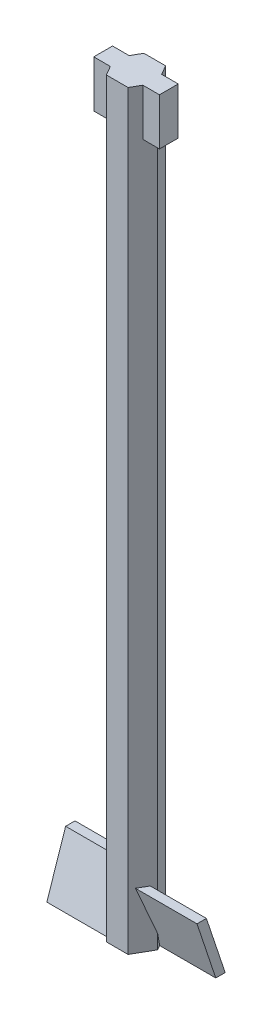
ISO-10303-21;
HEADER;
FILE_DESCRIPTION(('STEP AP214'),'2;1');
FILE_NAME('part.step','',(''),(''),'','','');
FILE_SCHEMA(('AUTOMOTIVE_DESIGN { 1 0 10303 214 1 1 1 1 }'));
ENDSEC;
DATA;
#1=APPLICATION_CONTEXT('core data for automotive mechanical design processes');
#2=APPLICATION_PROTOCOL_DEFINITION('international standard','automotive_design',2000,#1);
#3=PRODUCT_CONTEXT('',#1,'mechanical');
#4=PRODUCT('Part','Part','',(#3));
#5=PRODUCT_RELATED_PRODUCT_CATEGORY('part','',(#4));
#6=PRODUCT_DEFINITION_FORMATION('','',#4);
#7=PRODUCT_DEFINITION_CONTEXT('part definition',#1,'design');
#8=PRODUCT_DEFINITION('design','',#6,#7);
#9=PRODUCT_DEFINITION_SHAPE('','',#8);
#10=(LENGTH_UNIT() NAMED_UNIT(*) SI_UNIT(.MILLI.,.METRE.));
#11=(NAMED_UNIT(*) PLANE_ANGLE_UNIT() SI_UNIT($,.RADIAN.));
#12=(NAMED_UNIT(*) SI_UNIT($,.STERADIAN.) SOLID_ANGLE_UNIT());
#13=UNCERTAINTY_MEASURE_WITH_UNIT(LENGTH_MEASURE(1.E-05),#10,'distance_accuracy_value','');
#14=(GEOMETRIC_REPRESENTATION_CONTEXT(3) GLOBAL_UNCERTAINTY_ASSIGNED_CONTEXT((#13)) GLOBAL_UNIT_ASSIGNED_CONTEXT((#10,
#11,#12)) REPRESENTATION_CONTEXT('',''));
#15=CARTESIAN_POINT('',(0.,0.,0.));
#16=DIRECTION('',(0.,0.,1.));
#17=DIRECTION('',(1.,0.,0.));
#18=AXIS2_PLACEMENT_3D('',#15,#16,#17);
#19=CARTESIAN_POINT('',(-2.30940107675851,80.,0.));
#20=DIRECTION('',(0.866025403784443,0.,-0.499999999999993));
#21=DIRECTION('',(-0.499999999999993,0.,-0.866025403784443));
#22=AXIS2_PLACEMENT_3D('',#19,#20,#21);
#23=PLANE('',#22);
#24=DIRECTION('',(0.499999999999993,0.,0.866025403784443));
#25=VECTOR('',#24,1.);
#26=CARTESIAN_POINT('',(-2.30940107675851,0.,0.));
#27=LINE('',#26,#25);
#28=CARTESIAN_POINT('',(-2.30940107675851,0.,0.));
#29=VERTEX_POINT('',#28);
#30=CARTESIAN_POINT('',(-2.02072594216369,0.,0.5));
#31=VERTEX_POINT('',#30);
#32=EDGE_CURVE('E402',#29,#31,#27,.T.);
#33=ORIENTED_EDGE('',*,*,#32,.T.);
#34=DIRECTION('',(-0.179605302026771,0.933256525257383,-0.311085508419128));
#35=VECTOR('',#34,1.);
#36=CARTESIAN_POINT('',(-15.4673999536121,69.8709677419356,-22.7903225806452));
#37=LINE('',#36,#35);
#38=CARTESIAN_POINT('',(-2.30940107675851,1.50000000000007,0.));
#39=VERTEX_POINT('',#38);
#40=EDGE_CURVE('E247',#31,#39,#37,.T.);
#41=ORIENTED_EDGE('',*,*,#40,.T.);
#42=DIRECTION('',(0.,-1.,0.));
#43=VECTOR('',#42,1.);
#44=CARTESIAN_POINT('',(-2.30940107675851,80.,0.));
#45=LINE('',#44,#43);
#46=EDGE_CURVE('E431',#39,#29,#45,.T.);
#47=ORIENTED_EDGE('',*,*,#46,.T.);
#48=EDGE_LOOP('',(#33,#41,#47));
#49=FACE_BOUND('',#48,.T.);
#50=ADVANCED_FACE('F39',(#49),#23,.F.);
#51=CARTESIAN_POINT('',(1.15470053837924,80.,2.00000000000001));
#52=DIRECTION('',(-0.866025403784434,0.,-0.500000000000008));
#53=DIRECTION('',(-0.500000000000008,0.,0.866025403784434));
#54=AXIS2_PLACEMENT_3D('',#51,#52,#53);
#55=PLANE('',#54);
#56=DIRECTION('',(0.179605302026778,-0.933256525257382,-0.311085508419128));
#57=VECTOR('',#56,1.);
#58=CARTESIAN_POINT('',(-10.997591417951,70.6451612903225,23.0483870967742));
#59=LINE('',#58,#57);
#60=CARTESIAN_POINT('',(1.44337567297407,6.00000000000001,1.5));
#61=VERTEX_POINT('',#60);
#62=CARTESIAN_POINT('',(2.30940107675851,1.50000000000006,0.));
#63=VERTEX_POINT('',#62);
#64=EDGE_CURVE('E63',#61,#63,#59,.T.);
#65=ORIENTED_EDGE('',*,*,#64,.F.);
#66=DIRECTION('',(-0.500000000000008,0.,0.866025403784434));
#67=VECTOR('',#66,1.);
#68=CARTESIAN_POINT('',(1.15470053837924,6.00000000000001,2.00000000000001));
#69=LINE('',#68,#67);
#70=CARTESIAN_POINT('',(2.0207259421637,6.00000000000001,0.5));
#71=VERTEX_POINT('',#70);
#72=EDGE_CURVE('E48',#71,#61,#69,.T.);
#73=ORIENTED_EDGE('',*,*,#72,.F.);
#74=DIRECTION('',(-0.179605302026778,0.933256525257382,0.311085508419128));
#75=VECTOR('',#74,1.);
#76=CARTESIAN_POINT('',(-10.4947379576891,71.032258064516,22.1774193548387));
#77=LINE('',#76,#75);
#78=CARTESIAN_POINT('',(2.30940107675851,4.50000000000005,0.));
#79=VERTEX_POINT('',#78);
#80=EDGE_CURVE('E287',#79,#71,#77,.T.);
#81=ORIENTED_EDGE('',*,*,#80,.F.);
#82=DIRECTION('',(0.,-1.,0.));
#83=VECTOR('',#82,1.);
#84=CARTESIAN_POINT('',(2.30940107675851,80.,0.));
#85=LINE('',#84,#83);
#86=CARTESIAN_POINT('',(2.30940107675851,75.,0.));
#87=VERTEX_POINT('',#86);
#88=EDGE_CURVE('E420',#87,#79,#85,.T.);
#89=ORIENTED_EDGE('',*,*,#88,.F.);
#90=DIRECTION('',(0.500000000000008,0.,-0.866025403784434));
#91=VECTOR('',#90,1.);
#92=CARTESIAN_POINT('',(1.15470053837924,75.,2.00000000000001));
#93=LINE('',#92,#91);
#94=CARTESIAN_POINT('',(1.73205080756888,75.,1.));
#95=VERTEX_POINT('',#94);
#96=EDGE_CURVE('E361',#95,#87,#93,.T.);
#97=ORIENTED_EDGE('',*,*,#96,.F.);
#98=DIRECTION('',(0.,1.,0.));
#99=VECTOR('',#98,1.);
#100=CARTESIAN_POINT('',(1.73205080756888,80.,1.));
#101=LINE('',#100,#99);
#102=CARTESIAN_POINT('',(1.73205080756888,80.,1.));
#103=VERTEX_POINT('',#102);
#104=EDGE_CURVE('E353',#95,#103,#101,.T.);
#105=ORIENTED_EDGE('',*,*,#104,.T.);
#106=DIRECTION('',(0.500000000000008,0.,-0.866025403784434));
#107=VECTOR('',#106,1.);
#108=CARTESIAN_POINT('',(1.15470053837924,80.,2.00000000000001));
#109=LINE('',#108,#107);
#110=CARTESIAN_POINT('',(1.15470053837924,80.,2.00000000000001));
#111=VERTEX_POINT('',#110);
#112=EDGE_CURVE('E386',#111,#103,#109,.T.);
#113=ORIENTED_EDGE('',*,*,#112,.F.);
#114=DIRECTION('',(0.,-1.,0.));
#115=VECTOR('',#114,1.);
#116=CARTESIAN_POINT('',(1.15470053837924,80.,2.00000000000001));
#117=LINE('',#116,#115);
#118=CARTESIAN_POINT('',(1.15470053837924,0.,2.00000000000001));
#119=VERTEX_POINT('',#118);
#120=EDGE_CURVE('E423',#111,#119,#117,.T.);
#121=ORIENTED_EDGE('',*,*,#120,.T.);
#122=DIRECTION('',(0.500000000000008,0.,-0.866025403784434));
#123=VECTOR('',#122,1.);
#124=CARTESIAN_POINT('',(1.15470053837924,0.,2.00000000000001));
#125=LINE('',#124,#123);
#126=CARTESIAN_POINT('',(2.30940107675851,0.,0.));
#127=VERTEX_POINT('',#126);
#128=EDGE_CURVE('E409',#119,#127,#125,.T.);
#129=ORIENTED_EDGE('',*,*,#128,.T.);
#130=EDGE_CURVE('E419',#63,#127,#85,.T.);
#131=ORIENTED_EDGE('',*,*,#130,.F.);
#132=EDGE_LOOP('',(#65,#73,#81,#89,#97,#105,#113,#121,#129,#131));
#133=FACE_BOUND('',#132,.T.);
#134=ADVANCED_FACE('F460',(#133),#55,.F.);
#135=CARTESIAN_POINT('',(2.30940107675851,80.,0.));
#136=DIRECTION('',(-0.866025403784443,0.,0.499999999999992));
#137=DIRECTION('',(0.499999999999992,0.,0.866025403784443));
#138=AXIS2_PLACEMENT_3D('',#135,#136,#137);
#139=PLANE('',#138);
#140=DIRECTION('',(-0.179605302026771,-0.933256525257383,-0.311085508419128));
#141=VECTOR('',#140,1.);
#142=CARTESIAN_POINT('',(15.4673999536121,69.8709677419356,22.7903225806452));
#143=LINE('',#142,#141);
#144=CARTESIAN_POINT('',(2.02072594216369,0.,-0.5));
#145=VERTEX_POINT('',#144);
#146=EDGE_CURVE('E291',#63,#145,#143,.T.);
#147=ORIENTED_EDGE('',*,*,#146,.F.);
#148=ORIENTED_EDGE('',*,*,#130,.T.);
#149=DIRECTION('',(-0.499999999999992,0.,-0.866025403784443));
#150=VECTOR('',#149,1.);
#151=CARTESIAN_POINT('',(2.30940107675851,0.,0.));
#152=LINE('',#151,#150);
#153=EDGE_CURVE('E376',#127,#145,#152,.T.);
#154=ORIENTED_EDGE('',*,*,#153,.T.);
#155=EDGE_LOOP('',(#147,#148,#154));
#156=FACE_BOUND('',#155,.T.);
#157=ADVANCED_FACE('F531',(#156),#139,.F.);
#158=DIRECTION('',(0.179605302026771,0.933256525257383,0.311085508419128));
#159=VECTOR('',#158,1.);
#160=CARTESIAN_POINT('',(14.9645464933502,70.2580645161291,21.9193548387097));
#161=LINE('',#160,#159);
#162=CARTESIAN_POINT('',(1.44337567297408,0.,-1.5));
#163=VERTEX_POINT('',#162);
#164=EDGE_CURVE('E283',#163,#79,#161,.T.);
#165=ORIENTED_EDGE('',*,*,#164,.F.);
#166=CARTESIAN_POINT('',(1.15470053837927,0.,-2.));
#167=VERTEX_POINT('',#166);
#168=EDGE_CURVE('E413',#163,#167,#152,.T.);
#169=ORIENTED_EDGE('',*,*,#168,.T.);
#170=DIRECTION('',(0.,-1.,0.));
#171=VECTOR('',#170,1.);
#172=CARTESIAN_POINT('',(1.15470053837927,80.,-2.));
#173=LINE('',#172,#171);
#174=CARTESIAN_POINT('',(1.15470053837927,80.,-2.));
#175=VERTEX_POINT('',#174);
#176=EDGE_CURVE('E393',#175,#167,#173,.T.);
#177=ORIENTED_EDGE('',*,*,#176,.F.);
#178=DIRECTION('',(-0.499999999999992,0.,-0.866025403784443));
#179=VECTOR('',#178,1.);
#180=CARTESIAN_POINT('',(2.30940107675851,80.,0.));
#181=LINE('',#180,#179);
#182=CARTESIAN_POINT('',(1.73205080756888,80.,-1.));
#183=VERTEX_POINT('',#182);
#184=EDGE_CURVE('E390',#183,#175,#181,.T.);
#185=ORIENTED_EDGE('',*,*,#184,.F.);
#186=DIRECTION('',(0.,-1.,0.));
#187=VECTOR('',#186,1.);
#188=CARTESIAN_POINT('',(1.73205080756888,80.,-1.));
#189=LINE('',#188,#187);
#190=CARTESIAN_POINT('',(1.73205080756888,75.,-1.));
#191=VERTEX_POINT('',#190);
#192=EDGE_CURVE('E336',#183,#191,#189,.T.);
#193=ORIENTED_EDGE('',*,*,#192,.T.);
#194=DIRECTION('',(-0.499999999999992,0.,-0.866025403784443));
#195=VECTOR('',#194,1.);
#196=CARTESIAN_POINT('',(2.30940107675851,75.,0.));
#197=LINE('',#196,#195);
#198=EDGE_CURVE('E440',#87,#191,#197,.T.);
#199=ORIENTED_EDGE('',*,*,#198,.F.);
#200=ORIENTED_EDGE('',*,*,#88,.T.);
#201=EDGE_LOOP('',(#165,#169,#177,#185,#193,#199,#200));
#202=FACE_BOUND('',#201,.T.);
#203=ADVANCED_FACE('F464',(#202),#139,.F.);
#204=CARTESIAN_POINT('',(1.15470053837927,80.,-2.));
#205=DIRECTION('',(0.,0.,1.));
#206=DIRECTION('',(1.,0.,0.));
#207=AXIS2_PLACEMENT_3D('',#204,#205,#206);
#208=PLANE('',#207);
#209=DIRECTION('',(-1.,0.,0.));
#210=VECTOR('',#209,1.);
#211=CARTESIAN_POINT('',(1.15470053837927,0.,-2.));
#212=LINE('',#211,#210);
#213=CARTESIAN_POINT('',(-1.15470053837924,0.,-2.00000000000002));
#214=VERTEX_POINT('',#213);
#215=EDGE_CURVE('E370',#167,#214,#212,.T.);
#216=ORIENTED_EDGE('',*,*,#215,.T.);
#217=DIRECTION('',(0.,-1.,0.));
#218=VECTOR('',#217,1.);
#219=CARTESIAN_POINT('',(-1.15470053837924,80.,-2.00000000000002));
#220=LINE('',#219,#218);
#221=CARTESIAN_POINT('',(-1.15470053837924,80.,-2.00000000000002));
#222=VERTEX_POINT('',#221);
#223=EDGE_CURVE('E436',#222,#214,#220,.T.);
#224=ORIENTED_EDGE('',*,*,#223,.F.);
#225=DIRECTION('',(-1.,0.,0.));
#226=VECTOR('',#225,1.);
#227=CARTESIAN_POINT('',(1.15470053837927,80.,-2.));
#228=LINE('',#227,#226);
#229=EDGE_CURVE('E371',#175,#222,#228,.T.);
#230=ORIENTED_EDGE('',*,*,#229,.F.);
#231=ORIENTED_EDGE('',*,*,#176,.T.);
#232=EDGE_LOOP('',(#216,#224,#230,#231));
#233=FACE_BOUND('',#232,.T.);
#234=ADVANCED_FACE('F41',(#233),#208,.F.);
#235=CARTESIAN_POINT('',(-1.15470053837924,80.,-2.00000000000002));
#236=DIRECTION('',(0.866025403784434,0.,0.500000000000008));
#237=DIRECTION('',(0.500000000000008,0.,-0.866025403784434));
#238=AXIS2_PLACEMENT_3D('',#235,#236,#237);
#239=PLANE('',#238);
#240=ORIENTED_EDGE('',*,*,#46,.F.);
#241=DIRECTION('',(0.179605302026779,0.933256525257382,-0.311085508419127));
#242=VECTOR('',#241,1.);
#243=CARTESIAN_POINT('',(10.997591417951,70.6451612903225,-23.0483870967742));
#244=LINE('',#243,#242);
#245=CARTESIAN_POINT('',(-1.44337567297407,6.,-1.5));
#246=VERTEX_POINT('',#245);
#247=EDGE_CURVE('E251',#39,#246,#244,.T.);
#248=ORIENTED_EDGE('',*,*,#247,.T.);
#249=DIRECTION('',(-0.500000000000008,0.,0.866025403784434));
#250=VECTOR('',#249,1.);
#251=CARTESIAN_POINT('',(-1.15470053837924,6.00000000000001,-2.00000000000002));
#252=LINE('',#251,#250);
#253=CARTESIAN_POINT('',(-2.0207259421637,6.,-0.5));
#254=VERTEX_POINT('',#253);
#255=EDGE_CURVE('E11',#246,#254,#252,.T.);
#256=ORIENTED_EDGE('',*,*,#255,.T.);
#257=DIRECTION('',(-0.179605302026779,-0.933256525257382,0.311085508419127));
#258=VECTOR('',#257,1.);
#259=CARTESIAN_POINT('',(10.4947379576891,71.032258064516,-22.1774193548387));
#260=LINE('',#259,#258);
#261=CARTESIAN_POINT('',(-2.30940107675851,4.50000000000006,0.));
#262=VERTEX_POINT('',#261);
#263=EDGE_CURVE('E243',#254,#262,#260,.T.);
#264=ORIENTED_EDGE('',*,*,#263,.T.);
#265=CARTESIAN_POINT('',(-2.30940107675851,75.,0.));
#266=VERTEX_POINT('',#265);
#267=EDGE_CURVE('E432',#266,#262,#45,.T.);
#268=ORIENTED_EDGE('',*,*,#267,.F.);
#269=DIRECTION('',(-0.500000000000008,0.,0.866025403784434));
#270=VECTOR('',#269,1.);
#271=CARTESIAN_POINT('',(-1.15470053837924,75.,-2.00000000000002));
#272=LINE('',#271,#270);
#273=CARTESIAN_POINT('',(-1.73205080756888,75.,-0.999999999999999));
#274=VERTEX_POINT('',#273);
#275=EDGE_CURVE('E367',#274,#266,#272,.T.);
#276=ORIENTED_EDGE('',*,*,#275,.F.);
#277=DIRECTION('',(0.,1.,0.));
#278=VECTOR('',#277,1.);
#279=CARTESIAN_POINT('',(-1.73205080756888,80.,-1.));
#280=LINE('',#279,#278);
#281=CARTESIAN_POINT('',(-1.73205080756888,80.,-1.));
#282=VERTEX_POINT('',#281);
#283=EDGE_CURVE('E349',#274,#282,#280,.T.);
#284=ORIENTED_EDGE('',*,*,#283,.T.);
#285=DIRECTION('',(-0.500000000000008,0.,0.866025403784434));
#286=VECTOR('',#285,1.);
#287=CARTESIAN_POINT('',(-1.15470053837924,80.,-2.00000000000002));
#288=LINE('',#287,#286);
#289=EDGE_CURVE('E375',#222,#282,#288,.T.);
#290=ORIENTED_EDGE('',*,*,#289,.F.);
#291=ORIENTED_EDGE('',*,*,#223,.T.);
#292=DIRECTION('',(-0.500000000000008,0.,0.866025403784434));
#293=VECTOR('',#292,1.);
#294=CARTESIAN_POINT('',(-1.15470053837924,0.,-2.00000000000002));
#295=LINE('',#294,#293);
#296=EDGE_CURVE('E397',#214,#29,#295,.T.);
#297=ORIENTED_EDGE('',*,*,#296,.T.);
#298=EDGE_LOOP('',(#240,#248,#256,#264,#268,#276,#284,#290,#291,#297));
#299=FACE_BOUND('',#298,.T.);
#300=ADVANCED_FACE('F535',(#299),#239,.F.);
#301=ORIENTED_EDGE('',*,*,#267,.T.);
#302=DIRECTION('',(0.179605302026771,-0.933256525257383,0.311085508419128));
#303=VECTOR('',#302,1.);
#304=CARTESIAN_POINT('',(-14.9645464933502,70.2580645161291,-21.9193548387097));
#305=LINE('',#304,#303);
#306=CARTESIAN_POINT('',(-1.44337567297407,0.,1.5));
#307=VERTEX_POINT('',#306);
#308=EDGE_CURVE('E236',#262,#307,#305,.T.);
#309=ORIENTED_EDGE('',*,*,#308,.T.);
#310=CARTESIAN_POINT('',(-1.15470053837927,0.,1.99999999999999));
#311=VERTEX_POINT('',#310);
#312=EDGE_CURVE('E401',#307,#311,#27,.T.);
#313=ORIENTED_EDGE('',*,*,#312,.T.);
#314=DIRECTION('',(0.,-1.,0.));
#315=VECTOR('',#314,1.);
#316=CARTESIAN_POINT('',(-1.15470053837927,80.,1.99999999999999));
#317=LINE('',#316,#315);
#318=CARTESIAN_POINT('',(-1.15470053837927,80.,1.99999999999999));
#319=VERTEX_POINT('',#318);
#320=EDGE_CURVE('E427',#319,#311,#317,.T.);
#321=ORIENTED_EDGE('',*,*,#320,.F.);
#322=DIRECTION('',(0.499999999999993,0.,0.866025403784443));
#323=VECTOR('',#322,1.);
#324=CARTESIAN_POINT('',(-2.30940107675851,80.,0.));
#325=LINE('',#324,#323);
#326=CARTESIAN_POINT('',(-1.73205080756888,80.,1.));
#327=VERTEX_POINT('',#326);
#328=EDGE_CURVE('E380',#327,#319,#325,.T.);
#329=ORIENTED_EDGE('',*,*,#328,.F.);
#330=DIRECTION('',(0.,-1.,0.));
#331=VECTOR('',#330,1.);
#332=CARTESIAN_POINT('',(-1.73205080756888,80.,1.));
#333=LINE('',#332,#331);
#334=CARTESIAN_POINT('',(-1.73205080756888,75.,1.));
#335=VERTEX_POINT('',#334);
#336=EDGE_CURVE('E357',#327,#335,#333,.T.);
#337=ORIENTED_EDGE('',*,*,#336,.T.);
#338=DIRECTION('',(0.499999999999993,0.,0.866025403784443));
#339=VECTOR('',#338,1.);
#340=CARTESIAN_POINT('',(-2.30940107675851,75.,0.));
#341=LINE('',#340,#339);
#342=EDGE_CURVE('E364',#266,#335,#341,.T.);
#343=ORIENTED_EDGE('',*,*,#342,.F.);
#344=EDGE_LOOP('',(#301,#309,#313,#321,#329,#337,#343));
#345=FACE_BOUND('',#344,.T.);
#346=ADVANCED_FACE('F505',(#345),#23,.F.);
#347=CARTESIAN_POINT('',(-1.15470053837927,80.,1.99999999999999));
#348=DIRECTION('',(0.,0.,-1.));
#349=DIRECTION('',(-1.,0.,0.));
#350=AXIS2_PLACEMENT_3D('',#347,#348,#349);
#351=PLANE('',#350);
#352=DIRECTION('',(1.,0.,0.));
#353=VECTOR('',#352,1.);
#354=CARTESIAN_POINT('',(-1.15470053837927,0.,1.99999999999999));
#355=LINE('',#354,#353);
#356=EDGE_CURVE('E406',#311,#119,#355,.T.);
#357=ORIENTED_EDGE('',*,*,#356,.T.);
#358=ORIENTED_EDGE('',*,*,#120,.F.);
#359=DIRECTION('',(1.,0.,0.));
#360=VECTOR('',#359,1.);
#361=CARTESIAN_POINT('',(-1.15470053837927,80.,1.99999999999999));
#362=LINE('',#361,#360);
#363=EDGE_CURVE('E383',#319,#111,#362,.T.);
#364=ORIENTED_EDGE('',*,*,#363,.F.);
#365=ORIENTED_EDGE('',*,*,#320,.T.);
#366=EDGE_LOOP('',(#357,#358,#364,#365));
#367=FACE_BOUND('',#366,.T.);
#368=ADVANCED_FACE('F509',(#367),#351,.F.);
#369=CARTESIAN_POINT('',(0.,80.,0.));
#370=DIRECTION('',(0.,1.,0.));
#371=DIRECTION('',(0.,0.,1.));
#372=AXIS2_PLACEMENT_3D('',#369,#370,#371);
#373=PLANE('',#372);
#374=ORIENTED_EDGE('',*,*,#289,.T.);
#375=DIRECTION('',(-1.,0.,0.));
#376=VECTOR('',#375,1.);
#377=CARTESIAN_POINT('',(-3.5,80.,-1.));
#378=LINE('',#377,#376);
#379=CARTESIAN_POINT('',(-3.5,80.,-1.));
#380=VERTEX_POINT('',#379);
#381=EDGE_CURVE('E321',#282,#380,#378,.T.);
#382=ORIENTED_EDGE('',*,*,#381,.T.);
#383=DIRECTION('',(0.,0.,1.));
#384=VECTOR('',#383,1.);
#385=CARTESIAN_POINT('',(-3.5,80.,-1.));
#386=LINE('',#385,#384);
#387=CARTESIAN_POINT('',(-3.5,80.,1.));
#388=VERTEX_POINT('',#387);
#389=EDGE_CURVE('E325',#380,#388,#386,.T.);
#390=ORIENTED_EDGE('',*,*,#389,.T.);
#391=DIRECTION('',(1.,0.,0.));
#392=VECTOR('',#391,1.);
#393=CARTESIAN_POINT('',(-3.5,80.,1.));
#394=LINE('',#393,#392);
#395=EDGE_CURVE('E303',#388,#327,#394,.T.);
#396=ORIENTED_EDGE('',*,*,#395,.T.);
#397=ORIENTED_EDGE('',*,*,#328,.T.);
#398=ORIENTED_EDGE('',*,*,#363,.T.);
#399=ORIENTED_EDGE('',*,*,#112,.T.);
#400=CARTESIAN_POINT('',(3.5,80.,1.));
#401=VERTEX_POINT('',#400);
#402=EDGE_CURVE('E329',#103,#401,#394,.T.);
#403=ORIENTED_EDGE('',*,*,#402,.T.);
#404=DIRECTION('',(0.,0.,-1.));
#405=VECTOR('',#404,1.);
#406=CARTESIAN_POINT('',(3.5,80.,-1.));
#407=LINE('',#406,#405);
#408=CARTESIAN_POINT('',(3.5,80.,-1.));
#409=VERTEX_POINT('',#408);
#410=EDGE_CURVE('E297',#401,#409,#407,.T.);
#411=ORIENTED_EDGE('',*,*,#410,.T.);
#412=EDGE_CURVE('E322',#409,#183,#378,.T.);
#413=ORIENTED_EDGE('',*,*,#412,.T.);
#414=ORIENTED_EDGE('',*,*,#184,.T.);
#415=ORIENTED_EDGE('',*,*,#229,.T.);
#416=EDGE_LOOP('',(#374,#382,#390,#396,#397,#398,#399,#403,#411,#413,#414,#415));
#417=FACE_BOUND('',#416,.T.);
#418=ADVANCED_FACE('F486',(#417),#373,.T.);
#419=CARTESIAN_POINT('',(0.,0.,0.));
#420=DIRECTION('',(0.,1.,0.));
#421=DIRECTION('',(0.,0.,1.));
#422=AXIS2_PLACEMENT_3D('',#419,#420,#421);
#423=PLANE('',#422);
#424=ORIENTED_EDGE('',*,*,#312,.F.);
#425=DIRECTION('',(1.,0.,0.));
#426=VECTOR('',#425,1.);
#427=CARTESIAN_POINT('',(-8.,0.,1.5));
#428=LINE('',#427,#426);
#429=CARTESIAN_POINT('',(-8.,0.,1.5));
#430=VERTEX_POINT('',#429);
#431=EDGE_CURVE('E55',#430,#307,#428,.T.);
#432=ORIENTED_EDGE('',*,*,#431,.F.);
#433=DIRECTION('',(0.,0.,-1.));
#434=VECTOR('',#433,1.);
#435=CARTESIAN_POINT('',(-8.,0.,1.5));
#436=LINE('',#435,#434);
#437=CARTESIAN_POINT('',(-8.,0.,0.5));
#438=VERTEX_POINT('',#437);
#439=EDGE_CURVE('E212',#430,#438,#436,.T.);
#440=ORIENTED_EDGE('',*,*,#439,.T.);
#441=DIRECTION('',(1.,0.,0.));
#442=VECTOR('',#441,1.);
#443=CARTESIAN_POINT('',(-8.,0.,0.5));
#444=LINE('',#443,#442);
#445=EDGE_CURVE('E226',#438,#31,#444,.T.);
#446=ORIENTED_EDGE('',*,*,#445,.T.);
#447=ORIENTED_EDGE('',*,*,#32,.F.);
#448=ORIENTED_EDGE('',*,*,#296,.F.);
#449=ORIENTED_EDGE('',*,*,#215,.F.);
#450=ORIENTED_EDGE('',*,*,#168,.F.);
#451=DIRECTION('',(-1.,0.,0.));
#452=VECTOR('',#451,1.);
#453=CARTESIAN_POINT('',(8.,0.,-1.5));
#454=LINE('',#453,#452);
#455=CARTESIAN_POINT('',(8.,0.,-1.5));
#456=VERTEX_POINT('',#455);
#457=EDGE_CURVE('E275',#456,#163,#454,.T.);
#458=ORIENTED_EDGE('',*,*,#457,.F.);
#459=DIRECTION('',(0.,0.,-1.));
#460=VECTOR('',#459,1.);
#461=CARTESIAN_POINT('',(8.,0.,-1.5));
#462=LINE('',#461,#460);
#463=CARTESIAN_POINT('',(8.,0.,-0.5));
#464=VERTEX_POINT('',#463);
#465=EDGE_CURVE('E258',#464,#456,#462,.T.);
#466=ORIENTED_EDGE('',*,*,#465,.F.);
#467=DIRECTION('',(-1.,0.,0.));
#468=VECTOR('',#467,1.);
#469=CARTESIAN_POINT('',(8.,0.,-0.5));
#470=LINE('',#469,#468);
#471=EDGE_CURVE('E279',#464,#145,#470,.T.);
#472=ORIENTED_EDGE('',*,*,#471,.T.);
#473=ORIENTED_EDGE('',*,*,#153,.F.);
#474=ORIENTED_EDGE('',*,*,#128,.F.);
#475=ORIENTED_EDGE('',*,*,#356,.F.);
#476=EDGE_LOOP('',(#424,#432,#440,#446,#447,#448,#449,#450,#458,#466,#472,#473,#474,#475));
#477=FACE_BOUND('',#476,.T.);
#478=ADVANCED_FACE('F556',(#477),#423,.F.);
#479=CARTESIAN_POINT('',(3.5,75.,-1.));
#480=DIRECTION('',(1.,0.,0.));
#481=DIRECTION('',(0.,0.,-1.));
#482=AXIS2_PLACEMENT_3D('',#479,#480,#481);
#483=PLANE('',#482);
#484=ORIENTED_EDGE('',*,*,#410,.F.);
#485=DIRECTION('',(0.,1.,0.));
#486=VECTOR('',#485,1.);
#487=CARTESIAN_POINT('',(3.5,75.,1.));
#488=LINE('',#487,#486);
#489=CARTESIAN_POINT('',(3.5,75.,1.));
#490=VERTEX_POINT('',#489);
#491=EDGE_CURVE('E332',#490,#401,#488,.T.);
#492=ORIENTED_EDGE('',*,*,#491,.F.);
#493=DIRECTION('',(0.,0.,-1.));
#494=VECTOR('',#493,1.);
#495=CARTESIAN_POINT('',(3.5,75.,-1.));
#496=LINE('',#495,#494);
#497=CARTESIAN_POINT('',(3.5,75.,-1.));
#498=VERTEX_POINT('',#497);
#499=EDGE_CURVE('E298',#490,#498,#496,.T.);
#500=ORIENTED_EDGE('',*,*,#499,.T.);
#501=DIRECTION('',(0.,1.,0.));
#502=VECTOR('',#501,1.);
#503=CARTESIAN_POINT('',(3.5,75.,-1.));
#504=LINE('',#503,#502);
#505=EDGE_CURVE('E317',#498,#409,#504,.T.);
#506=ORIENTED_EDGE('',*,*,#505,.T.);
#507=EDGE_LOOP('',(#484,#492,#500,#506));
#508=FACE_BOUND('',#507,.T.);
#509=ADVANCED_FACE('F478',(#508),#483,.T.);
#510=CARTESIAN_POINT('',(0.,75.,0.));
#511=DIRECTION('',(0.,1.,0.));
#512=DIRECTION('',(0.,0.,1.));
#513=AXIS2_PLACEMENT_3D('',#510,#511,#512);
#514=PLANE('',#513);
#515=DIRECTION('',(1.,0.,0.));
#516=VECTOR('',#515,1.);
#517=CARTESIAN_POINT('',(-3.5,75.,1.));
#518=LINE('',#517,#516);
#519=EDGE_CURVE('E312',#95,#490,#518,.T.);
#520=ORIENTED_EDGE('',*,*,#519,.F.);
#521=ORIENTED_EDGE('',*,*,#96,.T.);
#522=ORIENTED_EDGE('',*,*,#198,.T.);
#523=DIRECTION('',(-1.,0.,0.));
#524=VECTOR('',#523,1.);
#525=CARTESIAN_POINT('',(-3.5,75.,-1.));
#526=LINE('',#525,#524);
#527=EDGE_CURVE('E304',#498,#191,#526,.T.);
#528=ORIENTED_EDGE('',*,*,#527,.F.);
#529=ORIENTED_EDGE('',*,*,#499,.F.);
#530=EDGE_LOOP('',(#520,#521,#522,#528,#529));
#531=FACE_BOUND('',#530,.T.);
#532=ADVANCED_FACE('F471',(#531),#514,.F.);
#533=CARTESIAN_POINT('',(-3.5,75.,-1.));
#534=DIRECTION('',(0.,0.,-1.));
#535=DIRECTION('',(-1.,0.,0.));
#536=AXIS2_PLACEMENT_3D('',#533,#534,#535);
#537=PLANE('',#536);
#538=ORIENTED_EDGE('',*,*,#192,.F.);
#539=ORIENTED_EDGE('',*,*,#412,.F.);
#540=ORIENTED_EDGE('',*,*,#505,.F.);
#541=ORIENTED_EDGE('',*,*,#527,.T.);
#542=EDGE_LOOP('',(#538,#539,#540,#541));
#543=FACE_BOUND('',#542,.T.);
#544=ADVANCED_FACE('F474',(#543),#537,.T.);
#545=CARTESIAN_POINT('',(-3.5,75.,1.));
#546=DIRECTION('',(0.,0.,1.));
#547=DIRECTION('',(1.,0.,0.));
#548=AXIS2_PLACEMENT_3D('',#545,#546,#547);
#549=PLANE('',#548);
#550=ORIENTED_EDGE('',*,*,#104,.F.);
#551=ORIENTED_EDGE('',*,*,#519,.T.);
#552=ORIENTED_EDGE('',*,*,#491,.T.);
#553=ORIENTED_EDGE('',*,*,#402,.F.);
#554=EDGE_LOOP('',(#550,#551,#552,#553));
#555=FACE_BOUND('',#554,.T.);
#556=ADVANCED_FACE('F512',(#555),#549,.T.);
#557=CARTESIAN_POINT('',(-3.5,75.,-1.));
#558=VERTEX_POINT('',#557);
#559=EDGE_CURVE('E302',#274,#558,#526,.T.);
#560=ORIENTED_EDGE('',*,*,#559,.F.);
#561=ORIENTED_EDGE('',*,*,#275,.T.);
#562=ORIENTED_EDGE('',*,*,#342,.T.);
#563=CARTESIAN_POINT('',(-3.5,75.,1.));
#564=VERTEX_POINT('',#563);
#565=EDGE_CURVE('E313',#564,#335,#518,.T.);
#566=ORIENTED_EDGE('',*,*,#565,.F.);
#567=DIRECTION('',(0.,0.,1.));
#568=VECTOR('',#567,1.);
#569=CARTESIAN_POINT('',(-3.5,75.,-1.));
#570=LINE('',#569,#568);
#571=EDGE_CURVE('E308',#558,#564,#570,.T.);
#572=ORIENTED_EDGE('',*,*,#571,.F.);
#573=EDGE_LOOP('',(#560,#561,#562,#566,#572));
#574=FACE_BOUND('',#573,.T.);
#575=ADVANCED_FACE('F514',(#574),#514,.F.);
#576=ORIENTED_EDGE('',*,*,#336,.F.);
#577=ORIENTED_EDGE('',*,*,#395,.F.);
#578=DIRECTION('',(0.,1.,0.));
#579=VECTOR('',#578,1.);
#580=CARTESIAN_POINT('',(-3.5,75.,1.));
#581=LINE('',#580,#579);
#582=EDGE_CURVE('E337',#564,#388,#581,.T.);
#583=ORIENTED_EDGE('',*,*,#582,.F.);
#584=ORIENTED_EDGE('',*,*,#565,.T.);
#585=EDGE_LOOP('',(#576,#577,#583,#584));
#586=FACE_BOUND('',#585,.T.);
#587=ADVANCED_FACE('F499',(#586),#549,.T.);
#588=ORIENTED_EDGE('',*,*,#283,.F.);
#589=ORIENTED_EDGE('',*,*,#559,.T.);
#590=DIRECTION('',(0.,1.,0.));
#591=VECTOR('',#590,1.);
#592=CARTESIAN_POINT('',(-3.5,75.,-1.));
#593=LINE('',#592,#591);
#594=EDGE_CURVE('E340',#558,#380,#593,.T.);
#595=ORIENTED_EDGE('',*,*,#594,.T.);
#596=ORIENTED_EDGE('',*,*,#381,.F.);
#597=EDGE_LOOP('',(#588,#589,#595,#596));
#598=FACE_BOUND('',#597,.T.);
#599=ADVANCED_FACE('F491',(#598),#537,.T.);
#600=CARTESIAN_POINT('',(-3.5,75.,-1.));
#601=DIRECTION('',(-1.,0.,0.));
#602=DIRECTION('',(0.,0.,1.));
#603=AXIS2_PLACEMENT_3D('',#600,#601,#602);
#604=PLANE('',#603);
#605=ORIENTED_EDGE('',*,*,#389,.F.);
#606=ORIENTED_EDGE('',*,*,#594,.F.);
#607=ORIENTED_EDGE('',*,*,#571,.T.);
#608=ORIENTED_EDGE('',*,*,#582,.T.);
#609=EDGE_LOOP('',(#605,#606,#607,#608));
#610=FACE_BOUND('',#609,.T.);
#611=ADVANCED_FACE('F495',(#610),#604,.T.);
#612=CARTESIAN_POINT('',(8.,6.,1.5));
#613=DIRECTION('',(0.,-1.,0.));
#614=DIRECTION('',(0.,0.,-1.));
#615=AXIS2_PLACEMENT_3D('',#612,#613,#614);
#616=PLANE('',#615);
#617=DIRECTION('',(-1.,0.,0.));
#618=VECTOR('',#617,1.);
#619=CARTESIAN_POINT('',(8.,6.,0.5));
#620=LINE('',#619,#618);
#621=CARTESIAN_POINT('',(8.,6.,0.5));
#622=VERTEX_POINT('',#621);
#623=EDGE_CURVE('E271',#622,#71,#620,.T.);
#624=ORIENTED_EDGE('',*,*,#623,.T.);
#625=ORIENTED_EDGE('',*,*,#72,.T.);
#626=DIRECTION('',(-1.,0.,0.));
#627=VECTOR('',#626,1.);
#628=CARTESIAN_POINT('',(8.,6.,1.5));
#629=LINE('',#628,#627);
#630=CARTESIAN_POINT('',(8.,6.,1.5));
#631=VERTEX_POINT('',#630);
#632=EDGE_CURVE('E267',#631,#61,#629,.T.);
#633=ORIENTED_EDGE('',*,*,#632,.F.);
#634=DIRECTION('',(0.,0.,1.));
#635=VECTOR('',#634,1.);
#636=CARTESIAN_POINT('',(8.,6.,1.5));
#637=LINE('',#636,#635);
#638=EDGE_CURVE('E264',#622,#631,#637,.T.);
#639=ORIENTED_EDGE('',*,*,#638,.F.);
#640=EDGE_LOOP('',(#624,#625,#633,#639));
#641=FACE_BOUND('',#640,.T.);
#642=ADVANCED_FACE('F445',(#641),#616,.F.);
#643=CARTESIAN_POINT('',(8.,6.,1.5));
#644=DIRECTION('',(0.,0.316227766016838,-0.948683298050514));
#645=DIRECTION('',(0.,0.948683298050514,0.316227766016838));
#646=AXIS2_PLACEMENT_3D('',#643,#644,#645);
#647=PLANE('',#646);
#648=ORIENTED_EDGE('',*,*,#632,.T.);
#649=ORIENTED_EDGE('',*,*,#64,.T.);
#650=ORIENTED_EDGE('',*,*,#146,.T.);
#651=ORIENTED_EDGE('',*,*,#471,.F.);
#652=DIRECTION('',(0.,-0.948683298050514,-0.316227766016838));
#653=VECTOR('',#652,1.);
#654=CARTESIAN_POINT('',(8.,6.,1.5));
#655=LINE('',#654,#653);
#656=EDGE_CURVE('E254',#631,#464,#655,.T.);
#657=ORIENTED_EDGE('',*,*,#656,.F.);
#658=EDGE_LOOP('',(#648,#649,#650,#651,#657));
#659=FACE_BOUND('',#658,.T.);
#660=ADVANCED_FACE('F451',(#659),#647,.F.);
#661=CARTESIAN_POINT('',(8.,6.,0.5));
#662=DIRECTION('',(0.,-0.316227766016838,0.948683298050514));
#663=DIRECTION('',(0.,-0.948683298050514,-0.316227766016838));
#664=AXIS2_PLACEMENT_3D('',#661,#662,#663);
#665=PLANE('',#664);
#666=ORIENTED_EDGE('',*,*,#164,.T.);
#667=ORIENTED_EDGE('',*,*,#80,.T.);
#668=ORIENTED_EDGE('',*,*,#623,.F.);
#669=DIRECTION('',(0.,0.948683298050514,0.316227766016838));
#670=VECTOR('',#669,1.);
#671=CARTESIAN_POINT('',(8.,6.,0.5));
#672=LINE('',#671,#670);
#673=EDGE_CURVE('E261',#456,#622,#672,.T.);
#674=ORIENTED_EDGE('',*,*,#673,.F.);
#675=ORIENTED_EDGE('',*,*,#457,.T.);
#676=EDGE_LOOP('',(#666,#667,#668,#674,#675));
#677=FACE_BOUND('',#676,.T.);
#678=ADVANCED_FACE('F458',(#677),#665,.F.);
#679=CARTESIAN_POINT('',(8.,0.,0.));
#680=DIRECTION('',(-1.,0.,0.));
#681=DIRECTION('',(0.,0.,1.));
#682=AXIS2_PLACEMENT_3D('',#679,#680,#681);
#683=PLANE('',#682);
#684=ORIENTED_EDGE('',*,*,#656,.T.);
#685=ORIENTED_EDGE('',*,*,#465,.T.);
#686=ORIENTED_EDGE('',*,*,#673,.T.);
#687=ORIENTED_EDGE('',*,*,#638,.T.);
#688=EDGE_LOOP('',(#684,#685,#686,#687));
#689=FACE_BOUND('',#688,.T.);
#690=ADVANCED_FACE('F454',(#689),#683,.F.);
#691=CARTESIAN_POINT('',(-8.,6.,-1.5));
#692=DIRECTION('',(0.,1.,0.));
#693=DIRECTION('',(0.,0.,1.));
#694=AXIS2_PLACEMENT_3D('',#691,#692,#693);
#695=PLANE('',#694);
#696=ORIENTED_EDGE('',*,*,#255,.F.);
#697=DIRECTION('',(1.,0.,0.));
#698=VECTOR('',#697,1.);
#699=CARTESIAN_POINT('',(-8.,6.,-1.5));
#700=LINE('',#699,#698);
#701=CARTESIAN_POINT('',(-8.,6.,-1.5));
#702=VERTEX_POINT('',#701);
#703=EDGE_CURVE('E202',#702,#246,#700,.T.);
#704=ORIENTED_EDGE('',*,*,#703,.F.);
#705=DIRECTION('',(0.,0.,1.));
#706=VECTOR('',#705,1.);
#707=CARTESIAN_POINT('',(-8.,6.,-1.5));
#708=LINE('',#707,#706);
#709=CARTESIAN_POINT('',(-8.,6.,-0.5));
#710=VERTEX_POINT('',#709);
#711=EDGE_CURVE('E206',#702,#710,#708,.T.);
#712=ORIENTED_EDGE('',*,*,#711,.T.);
#713=DIRECTION('',(1.,0.,0.));
#714=VECTOR('',#713,1.);
#715=CARTESIAN_POINT('',(-8.,6.,-0.5));
#716=LINE('',#715,#714);
#717=EDGE_CURVE('E211',#710,#254,#716,.T.);
#718=ORIENTED_EDGE('',*,*,#717,.T.);
#719=EDGE_LOOP('',(#696,#704,#712,#718));
#720=FACE_BOUND('',#719,.T.);
#721=ADVANCED_FACE('F204',(#720),#695,.T.);
#722=CARTESIAN_POINT('',(-8.,6.,-1.5));
#723=DIRECTION('',(0.,-0.316227766016838,-0.948683298050514));
#724=DIRECTION('',(0.,0.948683298050514,-0.316227766016838));
#725=AXIS2_PLACEMENT_3D('',#722,#723,#724);
#726=PLANE('',#725);
#727=ORIENTED_EDGE('',*,*,#247,.F.);
#728=ORIENTED_EDGE('',*,*,#40,.F.);
#729=ORIENTED_EDGE('',*,*,#445,.F.);
#730=DIRECTION('',(0.,0.948683298050514,-0.316227766016838));
#731=VECTOR('',#730,1.);
#732=CARTESIAN_POINT('',(-8.,6.,-1.5));
#733=LINE('',#732,#731);
#734=EDGE_CURVE('E219',#438,#702,#733,.T.);
#735=ORIENTED_EDGE('',*,*,#734,.T.);
#736=ORIENTED_EDGE('',*,*,#703,.T.);
#737=EDGE_LOOP('',(#727,#728,#729,#735,#736));
#738=FACE_BOUND('',#737,.T.);
#739=ADVANCED_FACE('F224',(#738),#726,.T.);
#740=CARTESIAN_POINT('',(-8.,6.,-0.5));
#741=DIRECTION('',(0.,0.316227766016838,0.948683298050514));
#742=DIRECTION('',(0.,-0.948683298050514,0.316227766016838));
#743=AXIS2_PLACEMENT_3D('',#740,#741,#742);
#744=PLANE('',#743);
#745=ORIENTED_EDGE('',*,*,#263,.F.);
#746=ORIENTED_EDGE('',*,*,#717,.F.);
#747=DIRECTION('',(0.,-0.948683298050514,0.316227766016838));
#748=VECTOR('',#747,1.);
#749=CARTESIAN_POINT('',(-8.,6.,-0.5));
#750=LINE('',#749,#748);
#751=EDGE_CURVE('E221',#710,#430,#750,.T.);
#752=ORIENTED_EDGE('',*,*,#751,.T.);
#753=ORIENTED_EDGE('',*,*,#431,.T.);
#754=ORIENTED_EDGE('',*,*,#308,.F.);
#755=EDGE_LOOP('',(#745,#746,#752,#753,#754));
#756=FACE_BOUND('',#755,.T.);
#757=ADVANCED_FACE('F560',(#756),#744,.T.);
#758=CARTESIAN_POINT('',(-8.,0.,0.));
#759=DIRECTION('',(1.,0.,0.));
#760=DIRECTION('',(0.,0.,-1.));
#761=AXIS2_PLACEMENT_3D('',#758,#759,#760);
#762=PLANE('',#761);
#763=ORIENTED_EDGE('',*,*,#734,.F.);
#764=ORIENTED_EDGE('',*,*,#439,.F.);
#765=ORIENTED_EDGE('',*,*,#751,.F.);
#766=ORIENTED_EDGE('',*,*,#711,.F.);
#767=EDGE_LOOP('',(#763,#764,#765,#766));
#768=FACE_BOUND('',#767,.T.);
#769=ADVANCED_FACE('F217',(#768),#762,.F.);
#770=CLOSED_SHELL('',(#50,#134,#157,#203,#234,#300,#346,#368,#418,#478,#509,#532,#544,#556,#575,
#587,#599,#611,#642,#660,#678,#690,#721,#739,#757,#769));
#771=MANIFOLD_SOLID_BREP('B2',#770);
#772=ADVANCED_BREP_SHAPE_REPRESENTATION('',(#18,#771),#14);
#773=SHAPE_DEFINITION_REPRESENTATION(#9,#772);
ENDSEC;
END-ISO-10303-21;
